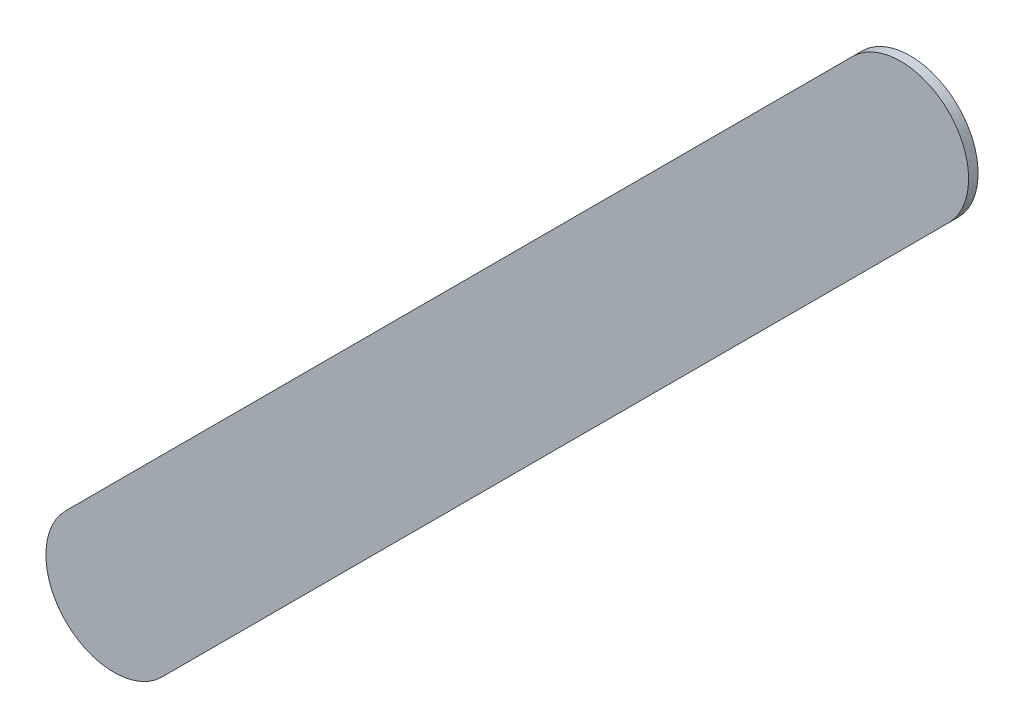
ISO-10303-21;
HEADER;
FILE_DESCRIPTION(('STEP AP214'),'2;1');
FILE_NAME('part.step','',(''),(''),'','','');
FILE_SCHEMA(('AUTOMOTIVE_DESIGN { 1 0 10303 214 1 1 1 1 }'));
ENDSEC;
DATA;
#1=APPLICATION_CONTEXT('core data for automotive mechanical design processes');
#2=APPLICATION_PROTOCOL_DEFINITION('international standard','automotive_design',2000,#1);
#3=PRODUCT_CONTEXT('',#1,'mechanical');
#4=PRODUCT('Part','Part','',(#3));
#5=PRODUCT_RELATED_PRODUCT_CATEGORY('part','',(#4));
#6=PRODUCT_DEFINITION_FORMATION('','',#4);
#7=PRODUCT_DEFINITION_CONTEXT('part definition',#1,'design');
#8=PRODUCT_DEFINITION('design','',#6,#7);
#9=PRODUCT_DEFINITION_SHAPE('','',#8);
#10=(LENGTH_UNIT() NAMED_UNIT(*) SI_UNIT(.MILLI.,.METRE.));
#11=(NAMED_UNIT(*) PLANE_ANGLE_UNIT() SI_UNIT($,.RADIAN.));
#12=(NAMED_UNIT(*) SI_UNIT($,.STERADIAN.) SOLID_ANGLE_UNIT());
#13=UNCERTAINTY_MEASURE_WITH_UNIT(LENGTH_MEASURE(1.E-05),#10,'distance_accuracy_value','');
#14=(GEOMETRIC_REPRESENTATION_CONTEXT(3) GLOBAL_UNCERTAINTY_ASSIGNED_CONTEXT((#13)) GLOBAL_UNIT_ASSIGNED_CONTEXT((#10,
#11,#12)) REPRESENTATION_CONTEXT('',''));
#15=CARTESIAN_POINT('',(0.,0.,0.));
#16=DIRECTION('',(0.,0.,1.));
#17=DIRECTION('',(1.,0.,0.));
#18=AXIS2_PLACEMENT_3D('',#15,#16,#17);
#19=CARTESIAN_POINT('',(176.963226,-113.25922,0.));
#20=DIRECTION('',(0.,0.,1.));
#21=DIRECTION('',(1.,0.,0.));
#22=AXIS2_PLACEMENT_3D('',#19,#20,#21);
#23=PLANE('',#22);
#24=DIRECTION('',(-0.707106781186548,-0.707106781186548,0.));
#25=VECTOR('',#24,1.);
#26=CARTESIAN_POINT('',(176.963226,-113.25922,0.));
#27=LINE('',#26,#25);
#28=CARTESIAN_POINT('',(176.963226,-113.25922,0.));
#29=VERTEX_POINT('',#28);
#30=CARTESIAN_POINT('',(174.067223,-116.155223,0.));
#31=VERTEX_POINT('',#30);
#32=EDGE_CURVE('E79',#29,#31,#27,.T.);
#33=ORIENTED_EDGE('',*,*,#32,.T.);
#34=CARTESIAN_POINT('',(174.2439995,-116.3319995,0.));
#35=DIRECTION('',(0.,0.,1.));
#36=DIRECTION('',(-0.707106781186548,0.707106781186548,0.));
#37=AXIS2_PLACEMENT_3D('',#34,#35,#36);
#38=CIRCLE('',#37,0.249999723809);
#39=CARTESIAN_POINT('',(174.420776,-116.508776,0.));
#40=VERTEX_POINT('',#39);
#41=EDGE_CURVE('E77',#31,#40,#38,.T.);
#42=ORIENTED_EDGE('',*,*,#41,.T.);
#43=DIRECTION('',(0.707106781186548,0.707106781186548,0.));
#44=VECTOR('',#43,1.);
#45=CARTESIAN_POINT('',(174.420776,-116.508776,0.));
#46=LINE('',#45,#44);
#47=CARTESIAN_POINT('',(177.316779,-113.612773,0.));
#48=VERTEX_POINT('',#47);
#49=EDGE_CURVE('E65',#40,#48,#46,.T.);
#50=ORIENTED_EDGE('',*,*,#49,.T.);
#51=CARTESIAN_POINT('',(177.1400025,-113.4359965,0.));
#52=DIRECTION('',(0.,0.,1.));
#53=DIRECTION('',(0.707106781186548,-0.707106781186548,0.));
#54=AXIS2_PLACEMENT_3D('',#51,#52,#53);
#55=CIRCLE('',#54,0.249999723809);
#56=EDGE_CURVE('E11',#48,#29,#55,.T.);
#57=ORIENTED_EDGE('',*,*,#56,.T.);
#58=EDGE_LOOP('',(#33,#42,#50,#57));
#59=FACE_BOUND('',#58,.T.);
#60=ADVANCED_FACE('F17',(#59),#23,.T.);
#61=CARTESIAN_POINT('',(176.963226,-113.25922,-0.035));
#62=DIRECTION('',(0.,0.,1.));
#63=DIRECTION('',(1.,0.,0.));
#64=AXIS2_PLACEMENT_3D('',#61,#62,#63);
#65=PLANE('',#64);
#66=CARTESIAN_POINT('',(177.1400025,-113.4359965,-0.035));
#67=DIRECTION('',(0.,0.,1.));
#68=DIRECTION('',(0.707106781186548,-0.707106781186548,0.));
#69=AXIS2_PLACEMENT_3D('',#66,#67,#68);
#70=CIRCLE('',#69,0.249999723809);
#71=CARTESIAN_POINT('',(177.316779,-113.612773,-0.035));
#72=VERTEX_POINT('',#71);
#73=CARTESIAN_POINT('',(176.963226,-113.25922,-0.035));
#74=VERTEX_POINT('',#73);
#75=EDGE_CURVE('E26',#72,#74,#70,.T.);
#76=ORIENTED_EDGE('',*,*,#75,.F.);
#77=DIRECTION('',(0.707106781186548,0.707106781186548,0.));
#78=VECTOR('',#77,1.);
#79=CARTESIAN_POINT('',(174.420776,-116.508776,-0.035));
#80=LINE('',#79,#78);
#81=CARTESIAN_POINT('',(174.420776,-116.508776,-0.035));
#82=VERTEX_POINT('',#81);
#83=EDGE_CURVE('E84',#82,#72,#80,.T.);
#84=ORIENTED_EDGE('',*,*,#83,.F.);
#85=CARTESIAN_POINT('',(174.2439995,-116.3319995,-0.035));
#86=DIRECTION('',(0.,0.,1.));
#87=DIRECTION('',(-0.707106781186548,0.707106781186548,0.));
#88=AXIS2_PLACEMENT_3D('',#85,#86,#87);
#89=CIRCLE('',#88,0.249999723809);
#90=CARTESIAN_POINT('',(174.067223,-116.155223,-0.035));
#91=VERTEX_POINT('',#90);
#92=EDGE_CURVE('E87',#91,#82,#89,.T.);
#93=ORIENTED_EDGE('',*,*,#92,.F.);
#94=DIRECTION('',(-0.707106781186548,-0.707106781186548,0.));
#95=VECTOR('',#94,1.);
#96=CARTESIAN_POINT('',(176.963226,-113.25922,-0.035));
#97=LINE('',#96,#95);
#98=EDGE_CURVE('E111',#74,#91,#97,.T.);
#99=ORIENTED_EDGE('',*,*,#98,.F.);
#100=EDGE_LOOP('',(#76,#84,#93,#99));
#101=FACE_BOUND('',#100,.T.);
#102=ADVANCED_FACE('F113',(#101),#65,.F.);
#103=CARTESIAN_POINT('',(177.1400025,-113.4359965,-0.035));
#104=DIRECTION('',(0.,0.,-1.));
#105=DIRECTION('',(0.707106781186548,-0.707106781186548,0.));
#106=AXIS2_PLACEMENT_3D('',#103,#104,#105);
#107=CYLINDRICAL_SURFACE('',#106,0.249999723809);
#108=ORIENTED_EDGE('',*,*,#75,.T.);
#109=DIRECTION('',(0.,0.,1.));
#110=VECTOR('',#109,1.);
#111=CARTESIAN_POINT('',(176.963226,-113.25922,-0.035));
#112=LINE('',#111,#110);
#113=EDGE_CURVE('E94',#74,#29,#112,.T.);
#114=ORIENTED_EDGE('',*,*,#113,.T.);
#115=ORIENTED_EDGE('',*,*,#56,.F.);
#116=DIRECTION('',(0.,0.,1.));
#117=VECTOR('',#116,1.);
#118=CARTESIAN_POINT('',(177.316779,-113.612773,-0.035));
#119=LINE('',#118,#117);
#120=EDGE_CURVE('E72',#72,#48,#119,.T.);
#121=ORIENTED_EDGE('',*,*,#120,.F.);
#122=EDGE_LOOP('',(#108,#114,#115,#121));
#123=FACE_BOUND('',#122,.T.);
#124=ADVANCED_FACE('F105',(#123),#107,.T.);
#125=CARTESIAN_POINT('',(174.420776,-116.508776,-0.035));
#126=DIRECTION('',(-0.707106781186548,0.707106781186548,0.));
#127=DIRECTION('',(0.,0.,1.));
#128=AXIS2_PLACEMENT_3D('',#125,#126,#127);
#129=PLANE('',#128);
#130=ORIENTED_EDGE('',*,*,#83,.T.);
#131=ORIENTED_EDGE('',*,*,#120,.T.);
#132=ORIENTED_EDGE('',*,*,#49,.F.);
#133=DIRECTION('',(0.,0.,1.));
#134=VECTOR('',#133,1.);
#135=CARTESIAN_POINT('',(174.420776,-116.508776,-0.035));
#136=LINE('',#135,#134);
#137=EDGE_CURVE('E70',#82,#40,#136,.T.);
#138=ORIENTED_EDGE('',*,*,#137,.F.);
#139=EDGE_LOOP('',(#130,#131,#132,#138));
#140=FACE_BOUND('',#139,.T.);
#141=ADVANCED_FACE('F68',(#140),#129,.F.);
#142=CARTESIAN_POINT('',(174.2439995,-116.3319995,-0.035));
#143=DIRECTION('',(0.,0.,-1.));
#144=DIRECTION('',(-0.707106781186548,0.707106781186548,0.));
#145=AXIS2_PLACEMENT_3D('',#142,#143,#144);
#146=CYLINDRICAL_SURFACE('',#145,0.249999723809);
#147=ORIENTED_EDGE('',*,*,#92,.T.);
#148=ORIENTED_EDGE('',*,*,#137,.T.);
#149=ORIENTED_EDGE('',*,*,#41,.F.);
#150=DIRECTION('',(0.,0.,1.));
#151=VECTOR('',#150,1.);
#152=CARTESIAN_POINT('',(174.067223,-116.155223,-0.035));
#153=LINE('',#152,#151);
#154=EDGE_CURVE('E115',#91,#31,#153,.T.);
#155=ORIENTED_EDGE('',*,*,#154,.F.);
#156=EDGE_LOOP('',(#147,#148,#149,#155));
#157=FACE_BOUND('',#156,.T.);
#158=ADVANCED_FACE('F86',(#157),#146,.T.);
#159=CARTESIAN_POINT('',(176.963226,-113.25922,-0.035));
#160=DIRECTION('',(0.707106781186548,-0.707106781186548,0.));
#161=DIRECTION('',(0.,0.,-1.));
#162=AXIS2_PLACEMENT_3D('',#159,#160,#161);
#163=PLANE('',#162);
#164=ORIENTED_EDGE('',*,*,#98,.T.);
#165=ORIENTED_EDGE('',*,*,#154,.T.);
#166=ORIENTED_EDGE('',*,*,#32,.F.);
#167=ORIENTED_EDGE('',*,*,#113,.F.);
#168=EDGE_LOOP('',(#164,#165,#166,#167));
#169=FACE_BOUND('',#168,.T.);
#170=ADVANCED_FACE('F110',(#169),#163,.F.);
#171=CLOSED_SHELL('',(#60,#102,#124,#141,#158,#170));
#172=MANIFOLD_SOLID_BREP('B1',#171);
#173=ADVANCED_BREP_SHAPE_REPRESENTATION('',(#18,#172),#14);
#174=SHAPE_DEFINITION_REPRESENTATION(#9,#173);
ENDSEC;
END-ISO-10303-21;
